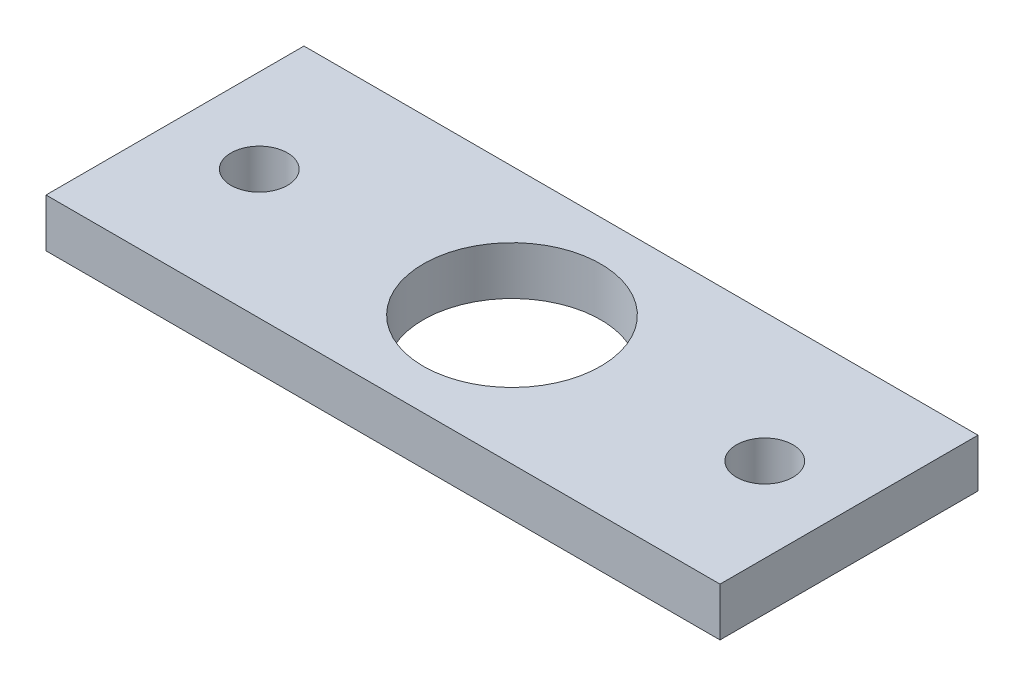
ISO-10303-21;
HEADER;
FILE_DESCRIPTION(('STEP AP214'),'2;1');
FILE_NAME('part.step','',(''),(''),'','','');
FILE_SCHEMA(('AUTOMOTIVE_DESIGN { 1 0 10303 214 1 1 1 1 }'));
ENDSEC;
DATA;
#1=APPLICATION_CONTEXT('core data for automotive mechanical design processes');
#2=APPLICATION_PROTOCOL_DEFINITION('international standard','automotive_design',2000,#1);
#3=PRODUCT_CONTEXT('',#1,'mechanical');
#4=PRODUCT('Part','Part','',(#3));
#5=PRODUCT_RELATED_PRODUCT_CATEGORY('part','',(#4));
#6=PRODUCT_DEFINITION_FORMATION('','',#4);
#7=PRODUCT_DEFINITION_CONTEXT('part definition',#1,'design');
#8=PRODUCT_DEFINITION('design','',#6,#7);
#9=PRODUCT_DEFINITION_SHAPE('','',#8);
#10=(LENGTH_UNIT() NAMED_UNIT(*) SI_UNIT(.MILLI.,.METRE.));
#11=(NAMED_UNIT(*) PLANE_ANGLE_UNIT() SI_UNIT($,.RADIAN.));
#12=(NAMED_UNIT(*) SI_UNIT($,.STERADIAN.) SOLID_ANGLE_UNIT());
#13=UNCERTAINTY_MEASURE_WITH_UNIT(LENGTH_MEASURE(1.E-05),#10,'distance_accuracy_value','');
#14=(GEOMETRIC_REPRESENTATION_CONTEXT(3) GLOBAL_UNCERTAINTY_ASSIGNED_CONTEXT((#13)) GLOBAL_UNIT_ASSIGNED_CONTEXT((#10,
#11,#12)) REPRESENTATION_CONTEXT('',''));
#15=CARTESIAN_POINT('',(0.,0.,0.));
#16=DIRECTION('',(0.,0.,1.));
#17=DIRECTION('',(1.,0.,0.));
#18=AXIS2_PLACEMENT_3D('',#15,#16,#17);
#19=CARTESIAN_POINT('',(0.,3.,8.00000000000001));
#20=DIRECTION('',(0.,0.,-1.));
#21=DIRECTION('',(-1.,0.,0.));
#22=AXIS2_PLACEMENT_3D('',#19,#20,#21);
#23=PLANE('',#22);
#24=DIRECTION('',(1.,0.,0.));
#25=VECTOR('',#24,1.);
#26=CARTESIAN_POINT('',(0.,0.,8.00000000000001));
#27=LINE('',#26,#25);
#28=CARTESIAN_POINT('',(-20.9,0.,8.00000000000001));
#29=VERTEX_POINT('',#28);
#30=CARTESIAN_POINT('',(20.9,0.,8.));
#31=VERTEX_POINT('',#30);
#32=EDGE_CURVE('E123',#29,#31,#27,.T.);
#33=ORIENTED_EDGE('',*,*,#32,.T.);
#34=DIRECTION('',(0.,-1.,0.));
#35=VECTOR('',#34,1.);
#36=CARTESIAN_POINT('',(20.9,3.,8.));
#37=LINE('',#36,#35);
#38=CARTESIAN_POINT('',(20.9,3.,8.));
#39=VERTEX_POINT('',#38);
#40=EDGE_CURVE('E11',#39,#31,#37,.T.);
#41=ORIENTED_EDGE('',*,*,#40,.F.);
#42=DIRECTION('',(1.,0.,0.));
#43=VECTOR('',#42,1.);
#44=CARTESIAN_POINT('',(0.,3.,8.00000000000001));
#45=LINE('',#44,#43);
#46=CARTESIAN_POINT('',(-20.9,3.,8.00000000000001));
#47=VERTEX_POINT('',#46);
#48=EDGE_CURVE('E93',#47,#39,#45,.T.);
#49=ORIENTED_EDGE('',*,*,#48,.F.);
#50=DIRECTION('',(0.,-1.,0.));
#51=VECTOR('',#50,1.);
#52=CARTESIAN_POINT('',(-20.9,3.,8.00000000000001));
#53=LINE('',#52,#51);
#54=EDGE_CURVE('E59',#47,#29,#53,.T.);
#55=ORIENTED_EDGE('',*,*,#54,.T.);
#56=EDGE_LOOP('',(#33,#41,#49,#55));
#57=FACE_BOUND('',#56,.T.);
#58=ADVANCED_FACE('F41',(#57),#23,.F.);
#59=CARTESIAN_POINT('',(20.9,3.,0.));
#60=DIRECTION('',(-1.,0.,0.));
#61=DIRECTION('',(0.,0.,1.));
#62=AXIS2_PLACEMENT_3D('',#59,#60,#61);
#63=PLANE('',#62);
#64=DIRECTION('',(0.,0.,-1.));
#65=VECTOR('',#64,1.);
#66=CARTESIAN_POINT('',(20.9,0.,0.));
#67=LINE('',#66,#65);
#68=CARTESIAN_POINT('',(20.9,0.,-8.));
#69=VERTEX_POINT('',#68);
#70=EDGE_CURVE('E99',#31,#69,#67,.T.);
#71=ORIENTED_EDGE('',*,*,#70,.T.);
#72=DIRECTION('',(0.,-1.,0.));
#73=VECTOR('',#72,1.);
#74=CARTESIAN_POINT('',(20.9,3.,-8.));
#75=LINE('',#74,#73);
#76=CARTESIAN_POINT('',(20.9,3.,-8.));
#77=VERTEX_POINT('',#76);
#78=EDGE_CURVE('E51',#77,#69,#75,.T.);
#79=ORIENTED_EDGE('',*,*,#78,.F.);
#80=DIRECTION('',(0.,0.,-1.));
#81=VECTOR('',#80,1.);
#82=CARTESIAN_POINT('',(20.9,3.,0.));
#83=LINE('',#82,#81);
#84=EDGE_CURVE('E84',#39,#77,#83,.T.);
#85=ORIENTED_EDGE('',*,*,#84,.F.);
#86=ORIENTED_EDGE('',*,*,#40,.T.);
#87=EDGE_LOOP('',(#71,#79,#85,#86));
#88=FACE_BOUND('',#87,.T.);
#89=ADVANCED_FACE('F98',(#88),#63,.F.);
#90=CARTESIAN_POINT('',(0.,3.,-8.));
#91=DIRECTION('',(0.,0.,-1.));
#92=DIRECTION('',(-1.,0.,0.));
#93=AXIS2_PLACEMENT_3D('',#90,#91,#92);
#94=PLANE('',#93);
#95=DIRECTION('',(1.,0.,0.));
#96=VECTOR('',#95,1.);
#97=CARTESIAN_POINT('',(0.,0.,-8.));
#98=LINE('',#97,#96);
#99=CARTESIAN_POINT('',(-20.9,0.,-8.));
#100=VERTEX_POINT('',#99);
#101=EDGE_CURVE('E128',#100,#69,#98,.T.);
#102=ORIENTED_EDGE('',*,*,#101,.F.);
#103=DIRECTION('',(0.,-1.,0.));
#104=VECTOR('',#103,1.);
#105=CARTESIAN_POINT('',(-20.9,3.,-8.));
#106=LINE('',#105,#104);
#107=CARTESIAN_POINT('',(-20.9,3.,-8.));
#108=VERTEX_POINT('',#107);
#109=EDGE_CURVE('E73',#108,#100,#106,.T.);
#110=ORIENTED_EDGE('',*,*,#109,.F.);
#111=DIRECTION('',(1.,0.,0.));
#112=VECTOR('',#111,1.);
#113=CARTESIAN_POINT('',(0.,3.,-8.));
#114=LINE('',#113,#112);
#115=EDGE_CURVE('E92',#108,#77,#114,.T.);
#116=ORIENTED_EDGE('',*,*,#115,.T.);
#117=ORIENTED_EDGE('',*,*,#78,.T.);
#118=EDGE_LOOP('',(#102,#110,#116,#117));
#119=FACE_BOUND('',#118,.T.);
#120=ADVANCED_FACE('F103',(#119),#94,.T.);
#121=CARTESIAN_POINT('',(-15.675,3.,0.));
#122=DIRECTION('',(0.,-1.,0.));
#123=DIRECTION('',(0.,0.,-1.));
#124=AXIS2_PLACEMENT_3D('',#121,#122,#123);
#125=CYLINDRICAL_SURFACE('',#124,1.75);
#126=CARTESIAN_POINT('',(-15.675,3.,0.));
#127=DIRECTION('',(0.,1.,0.));
#128=DIRECTION('',(0.,0.,1.));
#129=AXIS2_PLACEMENT_3D('',#126,#127,#128);
#130=CIRCLE('',#129,1.75);
#131=CARTESIAN_POINT('',(-15.675,3.,1.75));
#132=VERTEX_POINT('',#131);
#133=EDGE_CURVE('E108',#132,#132,#130,.T.);
#134=ORIENTED_EDGE('',*,*,#133,.T.);
#135=EDGE_LOOP('',(#134));
#136=FACE_BOUND('',#135,.T.);
#137=CARTESIAN_POINT('',(-15.675,0.,0.));
#138=DIRECTION('',(0.,1.,0.));
#139=DIRECTION('',(0.,0.,1.));
#140=AXIS2_PLACEMENT_3D('',#137,#138,#139);
#141=CIRCLE('',#140,1.75);
#142=CARTESIAN_POINT('',(-15.675,0.,1.75));
#143=VERTEX_POINT('',#142);
#144=EDGE_CURVE('E135',#143,#143,#141,.T.);
#145=ORIENTED_EDGE('',*,*,#144,.F.);
#146=EDGE_LOOP('',(#145));
#147=FACE_BOUND('',#146,.T.);
#148=ADVANCED_FACE('F177',(#136,#147),#125,.F.);
#149=CARTESIAN_POINT('',(-20.9,3.,0.));
#150=DIRECTION('',(-1.,0.,0.));
#151=DIRECTION('',(0.,0.,1.));
#152=AXIS2_PLACEMENT_3D('',#149,#150,#151);
#153=PLANE('',#152);
#154=DIRECTION('',(0.,0.,-1.));
#155=VECTOR('',#154,1.);
#156=CARTESIAN_POINT('',(-20.9,0.,0.));
#157=LINE('',#156,#155);
#158=EDGE_CURVE('E131',#29,#100,#157,.T.);
#159=ORIENTED_EDGE('',*,*,#158,.F.);
#160=ORIENTED_EDGE('',*,*,#54,.F.);
#161=DIRECTION('',(0.,0.,-1.));
#162=VECTOR('',#161,1.);
#163=CARTESIAN_POINT('',(-20.9,3.,0.));
#164=LINE('',#163,#162);
#165=EDGE_CURVE('E105',#47,#108,#164,.T.);
#166=ORIENTED_EDGE('',*,*,#165,.T.);
#167=ORIENTED_EDGE('',*,*,#109,.T.);
#168=EDGE_LOOP('',(#159,#160,#166,#167));
#169=FACE_BOUND('',#168,.T.);
#170=ADVANCED_FACE('F178',(#169),#153,.T.);
#171=CARTESIAN_POINT('',(0.,3.,0.));
#172=DIRECTION('',(0.,-1.,0.));
#173=DIRECTION('',(0.,0.,-1.));
#174=AXIS2_PLACEMENT_3D('',#171,#172,#173);
#175=CYLINDRICAL_SURFACE('',#174,5.5);
#176=CARTESIAN_POINT('',(0.,3.,0.));
#177=DIRECTION('',(0.,1.,0.));
#178=DIRECTION('',(0.,0.,1.));
#179=AXIS2_PLACEMENT_3D('',#176,#177,#178);
#180=CIRCLE('',#179,5.5);
#181=CARTESIAN_POINT('',(0.,3.,5.5));
#182=VERTEX_POINT('',#181);
#183=EDGE_CURVE('E143',#182,#182,#180,.T.);
#184=ORIENTED_EDGE('',*,*,#183,.T.);
#185=EDGE_LOOP('',(#184));
#186=FACE_BOUND('',#185,.T.);
#187=CARTESIAN_POINT('',(0.,0.,0.));
#188=DIRECTION('',(0.,1.,0.));
#189=DIRECTION('',(0.,0.,1.));
#190=AXIS2_PLACEMENT_3D('',#187,#188,#189);
#191=CIRCLE('',#190,5.5);
#192=CARTESIAN_POINT('',(0.,0.,5.5));
#193=VERTEX_POINT('',#192);
#194=EDGE_CURVE('E119',#193,#193,#191,.T.);
#195=ORIENTED_EDGE('',*,*,#194,.F.);
#196=EDGE_LOOP('',(#195));
#197=FACE_BOUND('',#196,.T.);
#198=ADVANCED_FACE('F43',(#186,#197),#175,.F.);
#199=CARTESIAN_POINT('',(15.675,3.,0.));
#200=DIRECTION('',(0.,-1.,0.));
#201=DIRECTION('',(0.,0.,-1.));
#202=AXIS2_PLACEMENT_3D('',#199,#200,#201);
#203=CYLINDRICAL_SURFACE('',#202,1.75);
#204=CARTESIAN_POINT('',(15.675,3.,0.));
#205=DIRECTION('',(0.,1.,0.));
#206=DIRECTION('',(0.,0.,1.));
#207=AXIS2_PLACEMENT_3D('',#204,#205,#206);
#208=CIRCLE('',#207,1.75);
#209=CARTESIAN_POINT('',(15.675,3.,1.75));
#210=VERTEX_POINT('',#209);
#211=EDGE_CURVE('E115',#210,#210,#208,.F.);
#212=ORIENTED_EDGE('',*,*,#211,.F.);
#213=EDGE_LOOP('',(#212));
#214=FACE_BOUND('',#213,.T.);
#215=CARTESIAN_POINT('',(15.675,0.,0.));
#216=DIRECTION('',(0.,1.,0.));
#217=DIRECTION('',(0.,0.,1.));
#218=AXIS2_PLACEMENT_3D('',#215,#216,#217);
#219=CIRCLE('',#218,1.75);
#220=CARTESIAN_POINT('',(15.675,0.,1.75));
#221=VERTEX_POINT('',#220);
#222=EDGE_CURVE('E139',#221,#221,#219,.F.);
#223=ORIENTED_EDGE('',*,*,#222,.T.);
#224=EDGE_LOOP('',(#223));
#225=FACE_BOUND('',#224,.T.);
#226=ADVANCED_FACE('F159',(#214,#225),#203,.F.);
#227=CARTESIAN_POINT('',(0.,3.,0.));
#228=DIRECTION('',(0.,1.,0.));
#229=DIRECTION('',(0.,0.,1.));
#230=AXIS2_PLACEMENT_3D('',#227,#228,#229);
#231=PLANE('',#230);
#232=ORIENTED_EDGE('',*,*,#183,.F.);
#233=EDGE_LOOP('',(#232));
#234=FACE_BOUND('',#233,.T.);
#235=ORIENTED_EDGE('',*,*,#48,.T.);
#236=ORIENTED_EDGE('',*,*,#84,.T.);
#237=ORIENTED_EDGE('',*,*,#115,.F.);
#238=ORIENTED_EDGE('',*,*,#165,.F.);
#239=EDGE_LOOP('',(#235,#236,#237,#238));
#240=FACE_BOUND('',#239,.T.);
#241=ORIENTED_EDGE('',*,*,#133,.F.);
#242=EDGE_LOOP('',(#241));
#243=FACE_BOUND('',#242,.T.);
#244=ORIENTED_EDGE('',*,*,#211,.T.);
#245=EDGE_LOOP('',(#244));
#246=FACE_BOUND('',#245,.T.);
#247=ADVANCED_FACE('F88',(#234,#240,#243,#246),#231,.T.);
#248=CARTESIAN_POINT('',(0.,0.,0.));
#249=DIRECTION('',(0.,1.,0.));
#250=DIRECTION('',(0.,0.,1.));
#251=AXIS2_PLACEMENT_3D('',#248,#249,#250);
#252=PLANE('',#251);
#253=ORIENTED_EDGE('',*,*,#194,.T.);
#254=EDGE_LOOP('',(#253));
#255=FACE_BOUND('',#254,.T.);
#256=ORIENTED_EDGE('',*,*,#32,.F.);
#257=ORIENTED_EDGE('',*,*,#158,.T.);
#258=ORIENTED_EDGE('',*,*,#101,.T.);
#259=ORIENTED_EDGE('',*,*,#70,.F.);
#260=EDGE_LOOP('',(#256,#257,#258,#259));
#261=FACE_BOUND('',#260,.T.);
#262=ORIENTED_EDGE('',*,*,#144,.T.);
#263=EDGE_LOOP('',(#262));
#264=FACE_BOUND('',#263,.T.);
#265=ORIENTED_EDGE('',*,*,#222,.F.);
#266=EDGE_LOOP('',(#265));
#267=FACE_BOUND('',#266,.T.);
#268=ADVANCED_FACE('F158',(#255,#261,#264,#267),#252,.F.);
#269=CLOSED_SHELL('',(#58,#89,#120,#148,#170,#198,#226,#247,#268));
#270=MANIFOLD_SOLID_BREP('B2',#269);
#271=ADVANCED_BREP_SHAPE_REPRESENTATION('',(#18,#270),#14);
#272=SHAPE_DEFINITION_REPRESENTATION(#9,#271);
ENDSEC;
END-ISO-10303-21;
